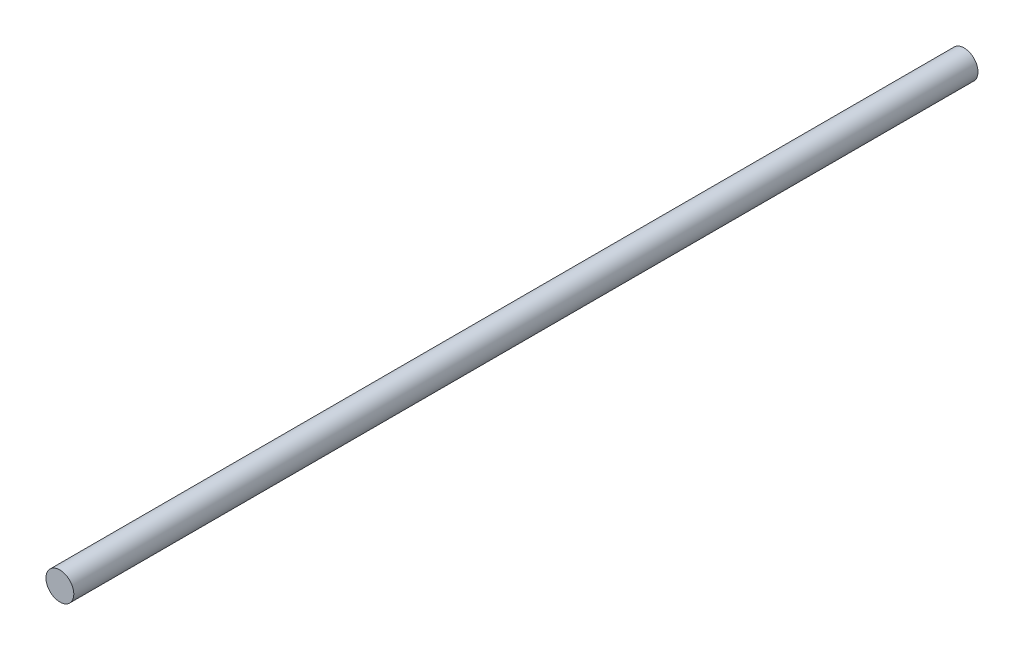
ISO-10303-21;
HEADER;
FILE_DESCRIPTION(('STEP AP214'),'2;1');
FILE_NAME('part.step','',(''),(''),'','','');
FILE_SCHEMA(('AUTOMOTIVE_DESIGN { 1 0 10303 214 1 1 1 1 }'));
ENDSEC;
DATA;
#1=APPLICATION_CONTEXT('core data for automotive mechanical design processes');
#2=APPLICATION_PROTOCOL_DEFINITION('international standard','automotive_design',2000,#1);
#3=PRODUCT_CONTEXT('',#1,'mechanical');
#4=PRODUCT('Part','Part','',(#3));
#5=PRODUCT_RELATED_PRODUCT_CATEGORY('part','',(#4));
#6=PRODUCT_DEFINITION_FORMATION('','',#4);
#7=PRODUCT_DEFINITION_CONTEXT('part definition',#1,'design');
#8=PRODUCT_DEFINITION('design','',#6,#7);
#9=PRODUCT_DEFINITION_SHAPE('','',#8);
#10=(LENGTH_UNIT() NAMED_UNIT(*) SI_UNIT(.MILLI.,.METRE.));
#11=(NAMED_UNIT(*) PLANE_ANGLE_UNIT() SI_UNIT($,.RADIAN.));
#12=(NAMED_UNIT(*) SI_UNIT($,.STERADIAN.) SOLID_ANGLE_UNIT());
#13=UNCERTAINTY_MEASURE_WITH_UNIT(LENGTH_MEASURE(1.E-05),#10,'distance_accuracy_value','');
#14=(GEOMETRIC_REPRESENTATION_CONTEXT(3) GLOBAL_UNCERTAINTY_ASSIGNED_CONTEXT((#13)) GLOBAL_UNIT_ASSIGNED_CONTEXT((#10,
#11,#12)) REPRESENTATION_CONTEXT('',''));
#15=CARTESIAN_POINT('',(0.,0.,0.));
#16=DIRECTION('',(0.,0.,1.));
#17=DIRECTION('',(1.,0.,0.));
#18=AXIS2_PLACEMENT_3D('',#15,#16,#17);
#19=CARTESIAN_POINT('',(0.,0.,325.));
#20=DIRECTION('',(0.,0.,-1.));
#21=DIRECTION('',(-1.,0.,0.));
#22=AXIS2_PLACEMENT_3D('',#19,#20,#21);
#23=CYLINDRICAL_SURFACE('',#22,5.);
#24=CARTESIAN_POINT('',(0.,0.,325.));
#25=DIRECTION('',(0.,0.,1.));
#26=DIRECTION('',(1.,0.,0.));
#27=AXIS2_PLACEMENT_3D('',#24,#25,#26);
#28=CIRCLE('',#27,5.);
#29=CARTESIAN_POINT('',(5.,0.,325.));
#30=VERTEX_POINT('',#29);
#31=EDGE_CURVE('E10',#30,#30,#28,.T.);
#32=ORIENTED_EDGE('',*,*,#31,.F.);
#33=EDGE_LOOP('',(#32));
#34=FACE_BOUND('',#33,.T.);
#35=CARTESIAN_POINT('',(0.,0.,0.));
#36=DIRECTION('',(0.,0.,1.));
#37=DIRECTION('',(1.,0.,0.));
#38=AXIS2_PLACEMENT_3D('',#35,#36,#37);
#39=CIRCLE('',#38,5.);
#40=CARTESIAN_POINT('',(5.,0.,0.));
#41=VERTEX_POINT('',#40);
#42=EDGE_CURVE('E35',#41,#41,#39,.T.);
#43=ORIENTED_EDGE('',*,*,#42,.T.);
#44=EDGE_LOOP('',(#43));
#45=FACE_BOUND('',#44,.T.);
#46=ADVANCED_FACE('F32',(#34,#45),#23,.T.);
#47=CARTESIAN_POINT('',(0.,0.,325.));
#48=DIRECTION('',(0.,0.,1.));
#49=DIRECTION('',(1.,0.,0.));
#50=AXIS2_PLACEMENT_3D('',#47,#48,#49);
#51=PLANE('',#50);
#52=ORIENTED_EDGE('',*,*,#31,.T.);
#53=EDGE_LOOP('',(#52));
#54=FACE_BOUND('',#53,.T.);
#55=ADVANCED_FACE('F47',(#54),#51,.T.);
#56=CARTESIAN_POINT('',(0.,0.,0.));
#57=DIRECTION('',(0.,0.,1.));
#58=DIRECTION('',(1.,0.,0.));
#59=AXIS2_PLACEMENT_3D('',#56,#57,#58);
#60=PLANE('',#59);
#61=ORIENTED_EDGE('',*,*,#42,.F.);
#62=EDGE_LOOP('',(#61));
#63=FACE_BOUND('',#62,.T.);
#64=ADVANCED_FACE('F45',(#63),#60,.F.);
#65=CLOSED_SHELL('',(#46,#55,#64));
#66=MANIFOLD_SOLID_BREP('B2',#65);
#67=ADVANCED_BREP_SHAPE_REPRESENTATION('',(#18,#66),#14);
#68=SHAPE_DEFINITION_REPRESENTATION(#9,#67);
ENDSEC;
END-ISO-10303-21;
